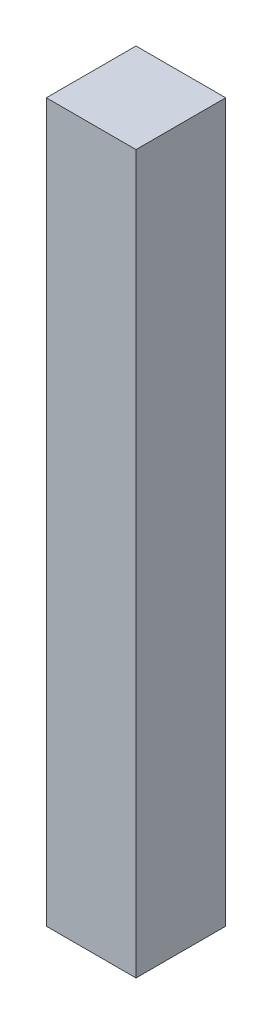
ISO-10303-21;
HEADER;
FILE_DESCRIPTION(('STEP AP214'),'2;1');
FILE_NAME('part.step','',(''),(''),'','','');
FILE_SCHEMA(('AUTOMOTIVE_DESIGN { 1 0 10303 214 1 1 1 1 }'));
ENDSEC;
DATA;
#1=APPLICATION_CONTEXT('core data for automotive mechanical design processes');
#2=APPLICATION_PROTOCOL_DEFINITION('international standard','automotive_design',2000,#1);
#3=PRODUCT_CONTEXT('',#1,'mechanical');
#4=PRODUCT('Part','Part','',(#3));
#5=PRODUCT_RELATED_PRODUCT_CATEGORY('part','',(#4));
#6=PRODUCT_DEFINITION_FORMATION('','',#4);
#7=PRODUCT_DEFINITION_CONTEXT('part definition',#1,'design');
#8=PRODUCT_DEFINITION('design','',#6,#7);
#9=PRODUCT_DEFINITION_SHAPE('','',#8);
#10=(LENGTH_UNIT() NAMED_UNIT(*) SI_UNIT(.MILLI.,.METRE.));
#11=(NAMED_UNIT(*) PLANE_ANGLE_UNIT() SI_UNIT($,.RADIAN.));
#12=(NAMED_UNIT(*) SI_UNIT($,.STERADIAN.) SOLID_ANGLE_UNIT());
#13=UNCERTAINTY_MEASURE_WITH_UNIT(LENGTH_MEASURE(1.E-05),#10,'distance_accuracy_value','');
#14=(GEOMETRIC_REPRESENTATION_CONTEXT(3) GLOBAL_UNCERTAINTY_ASSIGNED_CONTEXT((#13)) GLOBAL_UNIT_ASSIGNED_CONTEXT((#10,
#11,#12)) REPRESENTATION_CONTEXT('',''));
#15=CARTESIAN_POINT('',(0.,0.,0.));
#16=DIRECTION('',(0.,0.,1.));
#17=DIRECTION('',(1.,0.,0.));
#18=AXIS2_PLACEMENT_3D('',#15,#16,#17);
#19=CARTESIAN_POINT('',(-20.,0.,20.));
#20=DIRECTION('',(0.,-1.,0.));
#21=DIRECTION('',(0.,0.,-1.));
#22=AXIS2_PLACEMENT_3D('',#19,#20,#21);
#23=PLANE('',#22);
#24=DIRECTION('',(-1.,0.,0.));
#25=VECTOR('',#24,1.);
#26=CARTESIAN_POINT('',(-20.,0.,0.));
#27=LINE('',#26,#25);
#28=CARTESIAN_POINT('',(0.,0.,0.));
#29=VERTEX_POINT('',#28);
#30=CARTESIAN_POINT('',(-20.,0.,0.));
#31=VERTEX_POINT('',#30);
#32=EDGE_CURVE('E97',#29,#31,#27,.T.);
#33=ORIENTED_EDGE('',*,*,#32,.T.);
#34=DIRECTION('',(0.,0.,-1.));
#35=VECTOR('',#34,1.);
#36=CARTESIAN_POINT('',(-20.,0.,20.));
#37=LINE('',#36,#35);
#38=CARTESIAN_POINT('',(-20.,0.,20.));
#39=VERTEX_POINT('',#38);
#40=EDGE_CURVE('E11',#39,#31,#37,.T.);
#41=ORIENTED_EDGE('',*,*,#40,.F.);
#42=DIRECTION('',(-1.,0.,0.));
#43=VECTOR('',#42,1.);
#44=CARTESIAN_POINT('',(-20.,0.,20.));
#45=LINE('',#44,#43);
#46=CARTESIAN_POINT('',(0.,0.,20.));
#47=VERTEX_POINT('',#46);
#48=EDGE_CURVE('E85',#47,#39,#45,.T.);
#49=ORIENTED_EDGE('',*,*,#48,.F.);
#50=DIRECTION('',(0.,0.,-1.));
#51=VECTOR('',#50,1.);
#52=CARTESIAN_POINT('',(0.,0.,20.));
#53=LINE('',#52,#51);
#54=EDGE_CURVE('E93',#47,#29,#53,.T.);
#55=ORIENTED_EDGE('',*,*,#54,.T.);
#56=EDGE_LOOP('',(#33,#41,#49,#55));
#57=FACE_BOUND('',#56,.T.);
#58=ADVANCED_FACE('F34',(#57),#23,.F.);
#59=CARTESIAN_POINT('',(-20.,-160.,20.));
#60=DIRECTION('',(1.,0.,0.));
#61=DIRECTION('',(0.,0.,-1.));
#62=AXIS2_PLACEMENT_3D('',#59,#60,#61);
#63=PLANE('',#62);
#64=DIRECTION('',(0.,-1.,0.));
#65=VECTOR('',#64,1.);
#66=CARTESIAN_POINT('',(-20.,-160.,0.));
#67=LINE('',#66,#65);
#68=CARTESIAN_POINT('',(-20.,-160.,0.));
#69=VERTEX_POINT('',#68);
#70=EDGE_CURVE('E89',#31,#69,#67,.T.);
#71=ORIENTED_EDGE('',*,*,#70,.T.);
#72=DIRECTION('',(0.,0.,-1.));
#73=VECTOR('',#72,1.);
#74=CARTESIAN_POINT('',(-20.,-160.,20.));
#75=LINE('',#74,#73);
#76=CARTESIAN_POINT('',(-20.,-160.,20.));
#77=VERTEX_POINT('',#76);
#78=EDGE_CURVE('E42',#77,#69,#75,.T.);
#79=ORIENTED_EDGE('',*,*,#78,.F.);
#80=DIRECTION('',(0.,-1.,0.));
#81=VECTOR('',#80,1.);
#82=CARTESIAN_POINT('',(-20.,-160.,20.));
#83=LINE('',#82,#81);
#84=EDGE_CURVE('E80',#39,#77,#83,.T.);
#85=ORIENTED_EDGE('',*,*,#84,.F.);
#86=ORIENTED_EDGE('',*,*,#40,.T.);
#87=EDGE_LOOP('',(#71,#79,#85,#86));
#88=FACE_BOUND('',#87,.T.);
#89=ADVANCED_FACE('F88',(#88),#63,.F.);
#90=CARTESIAN_POINT('',(0.,-160.,20.));
#91=DIRECTION('',(0.,1.,0.));
#92=DIRECTION('',(0.,0.,1.));
#93=AXIS2_PLACEMENT_3D('',#90,#91,#92);
#94=PLANE('',#93);
#95=DIRECTION('',(1.,0.,0.));
#96=VECTOR('',#95,1.);
#97=CARTESIAN_POINT('',(0.,-160.,0.));
#98=LINE('',#97,#96);
#99=CARTESIAN_POINT('',(0.,-160.,0.));
#100=VERTEX_POINT('',#99);
#101=EDGE_CURVE('E67',#69,#100,#98,.T.);
#102=ORIENTED_EDGE('',*,*,#101,.T.);
#103=DIRECTION('',(0.,0.,-1.));
#104=VECTOR('',#103,1.);
#105=CARTESIAN_POINT('',(0.,-160.,20.));
#106=LINE('',#105,#104);
#107=CARTESIAN_POINT('',(0.,-160.,20.));
#108=VERTEX_POINT('',#107);
#109=EDGE_CURVE('E90',#108,#100,#106,.T.);
#110=ORIENTED_EDGE('',*,*,#109,.F.);
#111=DIRECTION('',(1.,0.,0.));
#112=VECTOR('',#111,1.);
#113=CARTESIAN_POINT('',(0.,-160.,20.));
#114=LINE('',#113,#112);
#115=EDGE_CURVE('E83',#77,#108,#114,.T.);
#116=ORIENTED_EDGE('',*,*,#115,.F.);
#117=ORIENTED_EDGE('',*,*,#78,.T.);
#118=EDGE_LOOP('',(#102,#110,#116,#117));
#119=FACE_BOUND('',#118,.T.);
#120=ADVANCED_FACE('F91',(#119),#94,.F.);
#121=CARTESIAN_POINT('',(0.,0.,20.));
#122=DIRECTION('',(-1.,0.,0.));
#123=DIRECTION('',(0.,0.,1.));
#124=AXIS2_PLACEMENT_3D('',#121,#122,#123);
#125=PLANE('',#124);
#126=DIRECTION('',(0.,1.,0.));
#127=VECTOR('',#126,1.);
#128=CARTESIAN_POINT('',(0.,0.,0.));
#129=LINE('',#128,#127);
#130=EDGE_CURVE('E73',#100,#29,#129,.T.);
#131=ORIENTED_EDGE('',*,*,#130,.T.);
#132=ORIENTED_EDGE('',*,*,#54,.F.);
#133=DIRECTION('',(0.,1.,0.));
#134=VECTOR('',#133,1.);
#135=CARTESIAN_POINT('',(0.,0.,20.));
#136=LINE('',#135,#134);
#137=EDGE_CURVE('E50',#108,#47,#136,.T.);
#138=ORIENTED_EDGE('',*,*,#137,.F.);
#139=ORIENTED_EDGE('',*,*,#109,.T.);
#140=EDGE_LOOP('',(#131,#132,#138,#139));
#141=FACE_BOUND('',#140,.T.);
#142=ADVANCED_FACE('F104',(#141),#125,.F.);
#143=CARTESIAN_POINT('',(0.,0.,20.));
#144=DIRECTION('',(0.,0.,-1.));
#145=DIRECTION('',(-1.,0.,0.));
#146=AXIS2_PLACEMENT_3D('',#143,#144,#145);
#147=PLANE('',#146);
#148=ORIENTED_EDGE('',*,*,#48,.T.);
#149=ORIENTED_EDGE('',*,*,#84,.T.);
#150=ORIENTED_EDGE('',*,*,#115,.T.);
#151=ORIENTED_EDGE('',*,*,#137,.T.);
#152=EDGE_LOOP('',(#148,#149,#150,#151));
#153=FACE_BOUND('',#152,.T.);
#154=ADVANCED_FACE('F81',(#153),#147,.F.);
#155=CARTESIAN_POINT('',(0.,0.,0.));
#156=DIRECTION('',(0.,0.,-1.));
#157=DIRECTION('',(-1.,0.,0.));
#158=AXIS2_PLACEMENT_3D('',#155,#156,#157);
#159=PLANE('',#158);
#160=ORIENTED_EDGE('',*,*,#32,.F.);
#161=ORIENTED_EDGE('',*,*,#130,.F.);
#162=ORIENTED_EDGE('',*,*,#101,.F.);
#163=ORIENTED_EDGE('',*,*,#70,.F.);
#164=EDGE_LOOP('',(#160,#161,#162,#163));
#165=FACE_BOUND('',#164,.T.);
#166=ADVANCED_FACE('F107',(#165),#159,.T.);
#167=CLOSED_SHELL('',(#58,#89,#120,#142,#154,#166));
#168=MANIFOLD_SOLID_BREP('B2',#167);
#169=ADVANCED_BREP_SHAPE_REPRESENTATION('',(#18,#168),#14);
#170=SHAPE_DEFINITION_REPRESENTATION(#9,#169);
ENDSEC;
END-ISO-10303-21;
